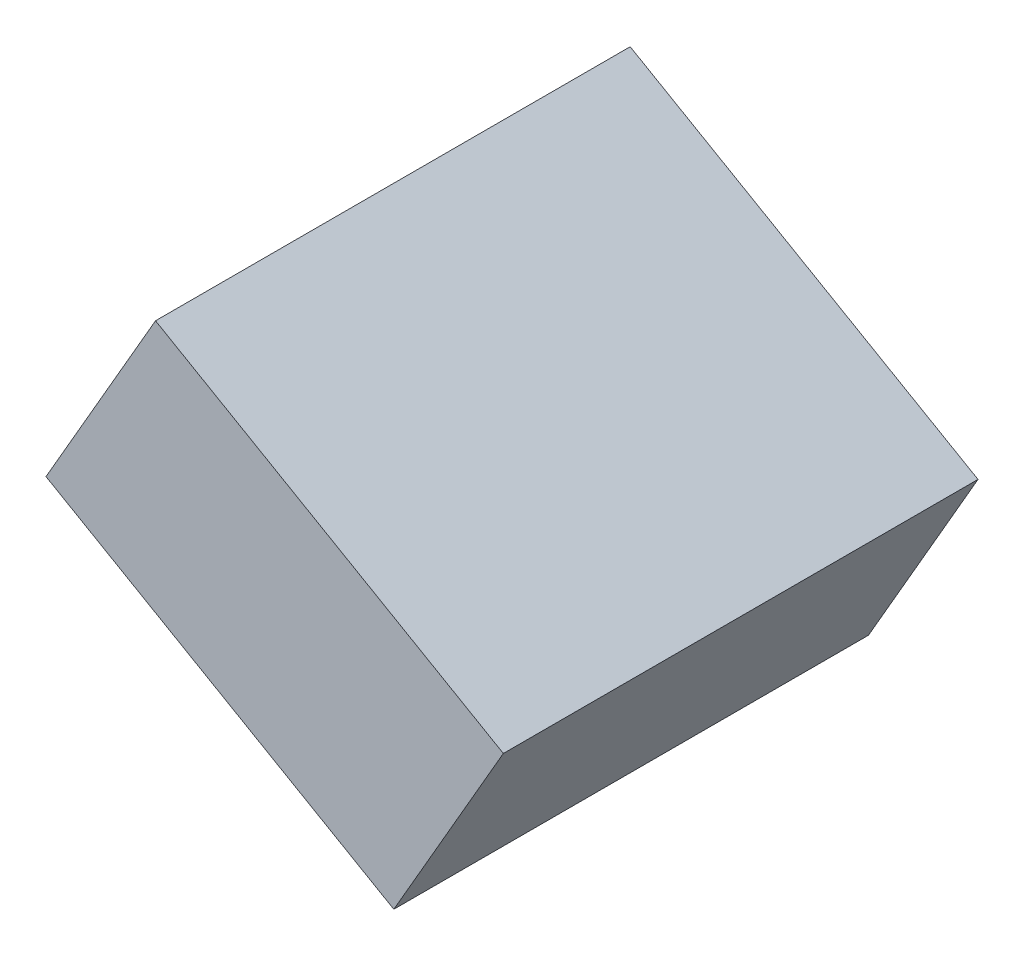
ISO-10303-21;
HEADER;
FILE_DESCRIPTION(('STEP AP214'),'2;1');
FILE_NAME('part.step','',(''),(''),'','','');
FILE_SCHEMA(('AUTOMOTIVE_DESIGN { 1 0 10303 214 1 1 1 1 }'));
ENDSEC;
DATA;
#1=APPLICATION_CONTEXT('core data for automotive mechanical design processes');
#2=APPLICATION_PROTOCOL_DEFINITION('international standard','automotive_design',2000,#1);
#3=PRODUCT_CONTEXT('',#1,'mechanical');
#4=PRODUCT('Part','Part','',(#3));
#5=PRODUCT_RELATED_PRODUCT_CATEGORY('part','',(#4));
#6=PRODUCT_DEFINITION_FORMATION('','',#4);
#7=PRODUCT_DEFINITION_CONTEXT('part definition',#1,'design');
#8=PRODUCT_DEFINITION('design','',#6,#7);
#9=PRODUCT_DEFINITION_SHAPE('','',#8);
#10=(LENGTH_UNIT() NAMED_UNIT(*) SI_UNIT(.MILLI.,.METRE.));
#11=(NAMED_UNIT(*) PLANE_ANGLE_UNIT() SI_UNIT($,.RADIAN.));
#12=(NAMED_UNIT(*) SI_UNIT($,.STERADIAN.) SOLID_ANGLE_UNIT());
#13=UNCERTAINTY_MEASURE_WITH_UNIT(LENGTH_MEASURE(1.E-05),#10,'distance_accuracy_value','');
#14=(GEOMETRIC_REPRESENTATION_CONTEXT(3) GLOBAL_UNCERTAINTY_ASSIGNED_CONTEXT((#13)) GLOBAL_UNIT_ASSIGNED_CONTEXT((#10,
#11,#12)) REPRESENTATION_CONTEXT('',''));
#15=CARTESIAN_POINT('',(0.,0.,0.));
#16=DIRECTION('',(0.,0.,1.));
#17=DIRECTION('',(1.,0.,0.));
#18=AXIS2_PLACEMENT_3D('',#15,#16,#17);
#19=CARTESIAN_POINT('',(-0.6263132,0.01519428,0.));
#20=DIRECTION('',(0.499999621666995,0.866025622214991,0.));
#21=DIRECTION('',(-0.866025622214991,0.499999621666995,0.));
#22=AXIS2_PLACEMENT_3D('',#19,#20,#21);
#23=PLANE('',#22);
#24=DIRECTION('',(0.,0.,1.));
#25=VECTOR('',#24,1.);
#26=CARTESIAN_POINT('',(0.3263138,-0.53480462,0.));
#27=LINE('',#26,#25);
#28=CARTESIAN_POINT('',(0.326313800000037,-0.534804619999936,0.));
#29=VERTEX_POINT('',#28);
#30=CARTESIAN_POINT('',(0.326313800000037,-0.534804619999936,1.29999994));
#31=VERTEX_POINT('',#30);
#32=EDGE_CURVE('E20',#29,#31,#27,.T.);
#33=ORIENTED_EDGE('',*,*,#32,.T.);
#34=DIRECTION('',(-0.866025622214856,0.499999621667228,0.));
#35=VECTOR('',#34,1.);
#36=CARTESIAN_POINT('',(0.3263138,-0.53480462,1.29999994));
#37=LINE('',#36,#35);
#38=CARTESIAN_POINT('',(-0.626313199999952,0.0151942799999725,1.29999994));
#39=VERTEX_POINT('',#38);
#40=EDGE_CURVE('E55',#31,#39,#37,.T.);
#41=ORIENTED_EDGE('',*,*,#40,.T.);
#42=DIRECTION('',(0.,0.,1.));
#43=VECTOR('',#42,1.);
#44=CARTESIAN_POINT('',(-0.626313199999809,0.0151942799998898,0.));
#45=LINE('',#44,#43);
#46=CARTESIAN_POINT('',(-0.626313199999952,0.0151942799999724,0.));
#47=VERTEX_POINT('',#46);
#48=EDGE_CURVE('E76',#39,#47,#45,.F.);
#49=ORIENTED_EDGE('',*,*,#48,.T.);
#50=DIRECTION('',(-0.866025622214856,0.499999621667228,0.));
#51=VECTOR('',#50,1.);
#52=CARTESIAN_POINT('',(0.3263138,-0.53480462,0.));
#53=LINE('',#52,#51);
#54=EDGE_CURVE('E58',#29,#47,#53,.T.);
#55=ORIENTED_EDGE('',*,*,#54,.F.);
#56=EDGE_LOOP('',(#33,#41,#49,#55));
#57=FACE_BOUND('',#56,.T.);
#58=ADVANCED_FACE('F17',(#57),#23,.F.);
#59=CARTESIAN_POINT('',(0.3263138,-0.53480462,0.));
#60=DIRECTION('',(-0.866023794167606,0.500002787927772,0.));
#61=DIRECTION('',(-0.500002787927772,-0.866023794167606,0.));
#62=AXIS2_PLACEMENT_3D('',#59,#60,#61);
#63=PLANE('',#62);
#64=DIRECTION('',(0.,0.,1.));
#65=VECTOR('',#64,1.);
#66=CARTESIAN_POINT('',(0.6263132,-0.01519428,0.));
#67=LINE('',#66,#65);
#68=CARTESIAN_POINT('',(0.62631320000004,-0.015194280000023,0.));
#69=VERTEX_POINT('',#68);
#70=CARTESIAN_POINT('',(0.62631320000004,-0.015194280000023,1.29999994));
#71=VERTEX_POINT('',#70);
#72=EDGE_CURVE('E73',#69,#71,#67,.T.);
#73=ORIENTED_EDGE('',*,*,#72,.T.);
#74=DIRECTION('',(-0.500002787927639,-0.866023794167683,0.));
#75=VECTOR('',#74,1.);
#76=CARTESIAN_POINT('',(0.6263132,-0.01519428,1.29999994));
#77=LINE('',#76,#75);
#78=EDGE_CURVE('E63',#71,#31,#77,.T.);
#79=ORIENTED_EDGE('',*,*,#78,.T.);
#80=ORIENTED_EDGE('',*,*,#32,.F.);
#81=DIRECTION('',(-0.500002787927639,-0.866023794167683,0.));
#82=VECTOR('',#81,1.);
#83=CARTESIAN_POINT('',(0.6263132,-0.01519428,0.));
#84=LINE('',#83,#82);
#85=EDGE_CURVE('E78',#69,#29,#84,.T.);
#86=ORIENTED_EDGE('',*,*,#85,.F.);
#87=EDGE_LOOP('',(#73,#79,#80,#86));
#88=FACE_BOUND('',#87,.T.);
#89=ADVANCED_FACE('F72',(#88),#63,.F.);
#90=CARTESIAN_POINT('',(0.6263132,-0.01519428,1.29999994));
#91=DIRECTION('',(0.,0.,-1.));
#92=DIRECTION('',(-1.,0.,0.));
#93=AXIS2_PLACEMENT_3D('',#90,#91,#92);
#94=PLANE('',#93);
#95=DIRECTION('',(0.500000954825115,0.8660248525152,0.));
#96=VECTOR('',#95,1.);
#97=CARTESIAN_POINT('',(-0.3263138,0.53480716,1.29999994));
#98=LINE('',#97,#96);
#99=CARTESIAN_POINT('',(-0.326313800000063,0.534807159999892,1.29999994));
#100=VERTEX_POINT('',#99);
#101=EDGE_CURVE('E69',#100,#39,#98,.F.);
#102=ORIENTED_EDGE('',*,*,#101,.T.);
#103=ORIENTED_EDGE('',*,*,#40,.F.);
#104=ORIENTED_EDGE('',*,*,#78,.F.);
#105=DIRECTION('',(0.866024622348075,-0.500001353485043,0.));
#106=VECTOR('',#105,1.);
#107=CARTESIAN_POINT('',(0.6263132,-0.01519428,1.29999994));
#108=LINE('',#107,#106);
#109=EDGE_CURVE('E83',#71,#100,#108,.F.);
#110=ORIENTED_EDGE('',*,*,#109,.T.);
#111=EDGE_LOOP('',(#102,#103,#104,#110));
#112=FACE_BOUND('',#111,.T.);
#113=ADVANCED_FACE('F66',(#112),#94,.F.);
#114=CARTESIAN_POINT('',(-0.3263138,0.53480716,0.));
#115=DIRECTION('',(0.8660248525152,-0.500000954825115,0.));
#116=DIRECTION('',(0.500000954825115,0.8660248525152,0.));
#117=AXIS2_PLACEMENT_3D('',#114,#115,#116);
#118=PLANE('',#117);
#119=ORIENTED_EDGE('',*,*,#48,.F.);
#120=ORIENTED_EDGE('',*,*,#101,.F.);
#121=DIRECTION('',(0.,0.,1.));
#122=VECTOR('',#121,1.);
#123=CARTESIAN_POINT('',(-0.326313800000251,0.534807159999566,0.));
#124=LINE('',#123,#122);
#125=CARTESIAN_POINT('',(-0.326313800000063,0.534807159999892,0.));
#126=VERTEX_POINT('',#125);
#127=EDGE_CURVE('E26',#100,#126,#124,.F.);
#128=ORIENTED_EDGE('',*,*,#127,.T.);
#129=DIRECTION('',(0.500000954825433,0.866024852515016,0.));
#130=VECTOR('',#129,1.);
#131=CARTESIAN_POINT('',(-0.6263132,0.01519428,0.));
#132=LINE('',#131,#130);
#133=EDGE_CURVE('E34',#47,#126,#132,.T.);
#134=ORIENTED_EDGE('',*,*,#133,.F.);
#135=EDGE_LOOP('',(#119,#120,#128,#134));
#136=FACE_BOUND('',#135,.T.);
#137=ADVANCED_FACE('F88',(#136),#118,.F.);
#138=CARTESIAN_POINT('',(0.6263132,-0.01519428,0.));
#139=DIRECTION('',(0.,0.,-1.));
#140=DIRECTION('',(-1.,0.,0.));
#141=AXIS2_PLACEMENT_3D('',#138,#139,#140);
#142=PLANE('',#141);
#143=ORIENTED_EDGE('',*,*,#133,.T.);
#144=DIRECTION('',(0.866024622348075,-0.500001353485043,0.));
#145=VECTOR('',#144,1.);
#146=CARTESIAN_POINT('',(0.6263132,-0.01519428,0.));
#147=LINE('',#146,#145);
#148=EDGE_CURVE('E11',#126,#69,#147,.T.);
#149=ORIENTED_EDGE('',*,*,#148,.T.);
#150=ORIENTED_EDGE('',*,*,#85,.T.);
#151=ORIENTED_EDGE('',*,*,#54,.T.);
#152=EDGE_LOOP('',(#143,#149,#150,#151));
#153=FACE_BOUND('',#152,.T.);
#154=ADVANCED_FACE('F91',(#153),#142,.T.);
#155=CARTESIAN_POINT('',(0.6263132,-0.01519428,0.));
#156=DIRECTION('',(-0.500001353485043,-0.866024622348075,0.));
#157=DIRECTION('',(0.866024622348075,-0.500001353485043,0.));
#158=AXIS2_PLACEMENT_3D('',#155,#156,#157);
#159=PLANE('',#158);
#160=ORIENTED_EDGE('',*,*,#127,.F.);
#161=ORIENTED_EDGE('',*,*,#109,.F.);
#162=ORIENTED_EDGE('',*,*,#72,.F.);
#163=ORIENTED_EDGE('',*,*,#148,.F.);
#164=EDGE_LOOP('',(#160,#161,#162,#163));
#165=FACE_BOUND('',#164,.T.);
#166=ADVANCED_FACE('F90',(#165),#159,.F.);
#167=CLOSED_SHELL('',(#58,#89,#113,#137,#154,#166));
#168=MANIFOLD_SOLID_BREP('B1',#167);
#169=ADVANCED_BREP_SHAPE_REPRESENTATION('',(#18,#168),#14);
#170=SHAPE_DEFINITION_REPRESENTATION(#9,#169);
ENDSEC;
END-ISO-10303-21;
